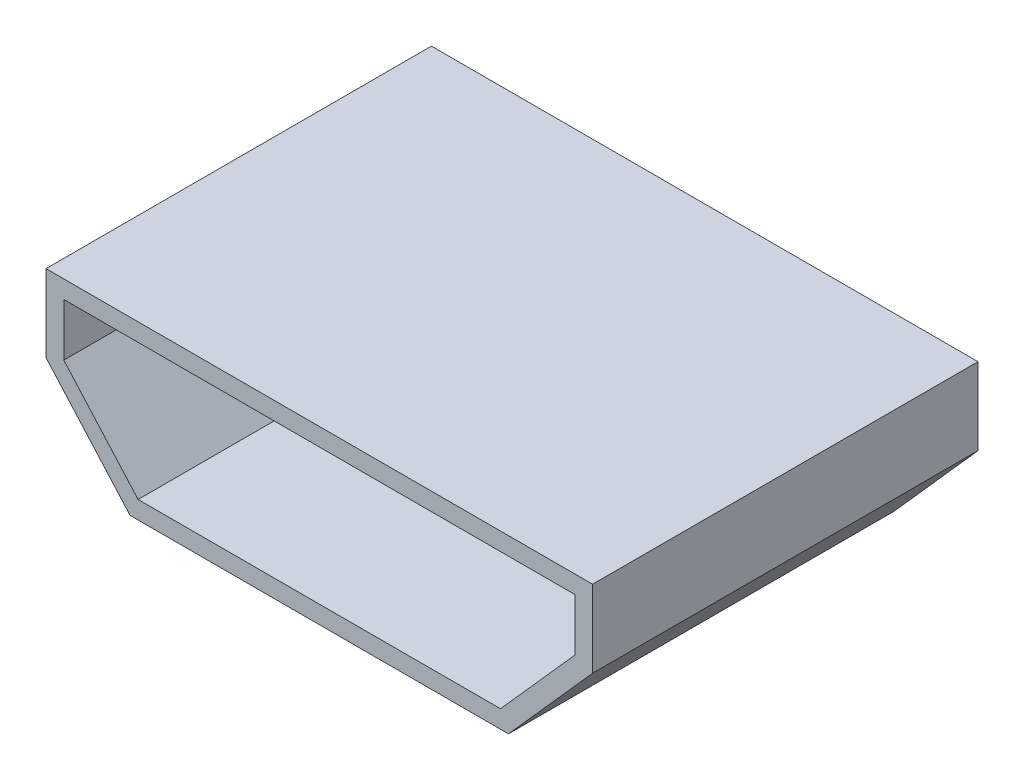
ISO-10303-21;
HEADER;
FILE_DESCRIPTION(('STEP AP214'),'2;1');
FILE_NAME('part.step','',(''),(''),'','','');
FILE_SCHEMA(('AUTOMOTIVE_DESIGN { 1 0 10303 214 1 1 1 1 }'));
ENDSEC;
DATA;
#1=APPLICATION_CONTEXT('core data for automotive mechanical design processes');
#2=APPLICATION_PROTOCOL_DEFINITION('international standard','automotive_design',2000,#1);
#3=PRODUCT_CONTEXT('',#1,'mechanical');
#4=PRODUCT('Part','Part','',(#3));
#5=PRODUCT_RELATED_PRODUCT_CATEGORY('part','',(#4));
#6=PRODUCT_DEFINITION_FORMATION('','',#4);
#7=PRODUCT_DEFINITION_CONTEXT('part definition',#1,'design');
#8=PRODUCT_DEFINITION('design','',#6,#7);
#9=PRODUCT_DEFINITION_SHAPE('','',#8);
#10=(LENGTH_UNIT() NAMED_UNIT(*) SI_UNIT(.MILLI.,.METRE.));
#11=(NAMED_UNIT(*) PLANE_ANGLE_UNIT() SI_UNIT($,.RADIAN.));
#12=(NAMED_UNIT(*) SI_UNIT($,.STERADIAN.) SOLID_ANGLE_UNIT());
#13=UNCERTAINTY_MEASURE_WITH_UNIT(LENGTH_MEASURE(1.E-05),#10,'distance_accuracy_value','');
#14=(GEOMETRIC_REPRESENTATION_CONTEXT(3) GLOBAL_UNCERTAINTY_ASSIGNED_CONTEXT((#13)) GLOBAL_UNIT_ASSIGNED_CONTEXT((#10,
#11,#12)) REPRESENTATION_CONTEXT('',''));
#15=CARTESIAN_POINT('',(0.,0.,0.));
#16=DIRECTION('',(0.,0.,1.));
#17=DIRECTION('',(1.,0.,0.));
#18=AXIS2_PLACEMENT_3D('',#15,#16,#17);
#19=CARTESIAN_POINT('',(2.7,0.,5.5));
#20=DIRECTION('',(-0.74740931868366,0.66436383882992,0.));
#21=DIRECTION('',(-0.66436383882992,-0.74740931868366,0.));
#22=AXIS2_PLACEMENT_3D('',#19,#20,#21);
#23=PLANE('',#22);
#24=DIRECTION('',(0.66436383882992,0.74740931868366,0.));
#25=VECTOR('',#24,1.);
#26=CARTESIAN_POINT('',(2.7,0.,0.));
#27=LINE('',#26,#25);
#28=CARTESIAN_POINT('',(2.7,0.,0.));
#29=VERTEX_POINT('',#28);
#30=CARTESIAN_POINT('',(3.9,1.35,0.));
#31=VERTEX_POINT('',#30);
#32=EDGE_CURVE('E128',#29,#31,#27,.T.);
#33=ORIENTED_EDGE('',*,*,#32,.T.);
#34=DIRECTION('',(0.,0.,-1.));
#35=VECTOR('',#34,1.);
#36=CARTESIAN_POINT('',(3.9,1.35,5.5));
#37=LINE('',#36,#35);
#38=CARTESIAN_POINT('',(3.9,1.35,5.5));
#39=VERTEX_POINT('',#38);
#40=EDGE_CURVE('E11',#39,#31,#37,.T.);
#41=ORIENTED_EDGE('',*,*,#40,.F.);
#42=DIRECTION('',(0.66436383882992,0.74740931868366,0.));
#43=VECTOR('',#42,1.);
#44=CARTESIAN_POINT('',(2.7,0.,5.5));
#45=LINE('',#44,#43);
#46=CARTESIAN_POINT('',(2.7,0.,5.5));
#47=VERTEX_POINT('',#46);
#48=EDGE_CURVE('E140',#47,#39,#45,.T.);
#49=ORIENTED_EDGE('',*,*,#48,.F.);
#50=DIRECTION('',(0.,0.,-1.));
#51=VECTOR('',#50,1.);
#52=CARTESIAN_POINT('',(2.7,0.,5.5));
#53=LINE('',#52,#51);
#54=EDGE_CURVE('E124',#47,#29,#53,.T.);
#55=ORIENTED_EDGE('',*,*,#54,.T.);
#56=EDGE_LOOP('',(#33,#41,#49,#55));
#57=FACE_BOUND('',#56,.T.);
#58=ADVANCED_FACE('F33',(#57),#23,.F.);
#59=CARTESIAN_POINT('',(3.9,1.35,5.5));
#60=DIRECTION('',(-1.,0.,0.));
#61=DIRECTION('',(0.,-1.,0.));
#62=AXIS2_PLACEMENT_3D('',#59,#60,#61);
#63=PLANE('',#62);
#64=DIRECTION('',(0.,1.,0.));
#65=VECTOR('',#64,1.);
#66=CARTESIAN_POINT('',(3.9,1.35,0.));
#67=LINE('',#66,#65);
#68=CARTESIAN_POINT('',(3.9,2.45,0.));
#69=VERTEX_POINT('',#68);
#70=EDGE_CURVE('E131',#31,#69,#67,.T.);
#71=ORIENTED_EDGE('',*,*,#70,.T.);
#72=DIRECTION('',(0.,0.,-1.));
#73=VECTOR('',#72,1.);
#74=CARTESIAN_POINT('',(3.9,2.45,5.5));
#75=LINE('',#74,#73);
#76=CARTESIAN_POINT('',(3.9,2.45,5.5));
#77=VERTEX_POINT('',#76);
#78=EDGE_CURVE('E40',#77,#69,#75,.T.);
#79=ORIENTED_EDGE('',*,*,#78,.F.);
#80=DIRECTION('',(0.,1.,0.));
#81=VECTOR('',#80,1.);
#82=CARTESIAN_POINT('',(3.9,1.35,5.5));
#83=LINE('',#82,#81);
#84=EDGE_CURVE('E91',#39,#77,#83,.T.);
#85=ORIENTED_EDGE('',*,*,#84,.F.);
#86=ORIENTED_EDGE('',*,*,#40,.T.);
#87=EDGE_LOOP('',(#71,#79,#85,#86));
#88=FACE_BOUND('',#87,.T.);
#89=ADVANCED_FACE('F263',(#88),#63,.F.);
#90=CARTESIAN_POINT('',(3.9,2.45,5.5));
#91=DIRECTION('',(0.,-1.,0.));
#92=DIRECTION('',(1.,0.,0.));
#93=AXIS2_PLACEMENT_3D('',#90,#91,#92);
#94=PLANE('',#93);
#95=DIRECTION('',(-1.,0.,0.));
#96=VECTOR('',#95,1.);
#97=CARTESIAN_POINT('',(3.9,2.45,0.));
#98=LINE('',#97,#96);
#99=CARTESIAN_POINT('',(-3.9,2.45,0.));
#100=VERTEX_POINT('',#99);
#101=EDGE_CURVE('E134',#69,#100,#98,.T.);
#102=ORIENTED_EDGE('',*,*,#101,.T.);
#103=DIRECTION('',(0.,0.,-1.));
#104=VECTOR('',#103,1.);
#105=CARTESIAN_POINT('',(-3.9,2.45,5.5));
#106=LINE('',#105,#104);
#107=CARTESIAN_POINT('',(-3.9,2.45,5.5));
#108=VERTEX_POINT('',#107);
#109=EDGE_CURVE('E119',#108,#100,#106,.T.);
#110=ORIENTED_EDGE('',*,*,#109,.F.);
#111=DIRECTION('',(-1.,0.,0.));
#112=VECTOR('',#111,1.);
#113=CARTESIAN_POINT('',(3.9,2.45,5.5));
#114=LINE('',#113,#112);
#115=EDGE_CURVE('E107',#77,#108,#114,.T.);
#116=ORIENTED_EDGE('',*,*,#115,.F.);
#117=ORIENTED_EDGE('',*,*,#78,.T.);
#118=EDGE_LOOP('',(#102,#110,#116,#117));
#119=FACE_BOUND('',#118,.T.);
#120=ADVANCED_FACE('F146',(#119),#94,.F.);
#121=CARTESIAN_POINT('',(-3.9,1.35,5.5));
#122=DIRECTION('',(1.,0.,0.));
#123=DIRECTION('',(0.,1.,0.));
#124=AXIS2_PLACEMENT_3D('',#121,#122,#123);
#125=PLANE('',#124);
#126=DIRECTION('',(0.,-1.,0.));
#127=VECTOR('',#126,1.);
#128=CARTESIAN_POINT('',(-3.9,1.35,0.));
#129=LINE('',#128,#127);
#130=CARTESIAN_POINT('',(-3.9,1.35,0.));
#131=VERTEX_POINT('',#130);
#132=EDGE_CURVE('E116',#100,#131,#129,.T.);
#133=ORIENTED_EDGE('',*,*,#132,.T.);
#134=DIRECTION('',(0.,0.,-1.));
#135=VECTOR('',#134,1.);
#136=CARTESIAN_POINT('',(-3.9,1.35,5.5));
#137=LINE('',#136,#135);
#138=CARTESIAN_POINT('',(-3.9,1.35,5.5));
#139=VERTEX_POINT('',#138);
#140=EDGE_CURVE('E113',#139,#131,#137,.T.);
#141=ORIENTED_EDGE('',*,*,#140,.F.);
#142=DIRECTION('',(0.,-1.,0.));
#143=VECTOR('',#142,1.);
#144=CARTESIAN_POINT('',(-3.9,1.35,5.5));
#145=LINE('',#144,#143);
#146=EDGE_CURVE('E100',#108,#139,#145,.T.);
#147=ORIENTED_EDGE('',*,*,#146,.F.);
#148=ORIENTED_EDGE('',*,*,#109,.T.);
#149=EDGE_LOOP('',(#133,#141,#147,#148));
#150=FACE_BOUND('',#149,.T.);
#151=ADVANCED_FACE('F114',(#150),#125,.F.);
#152=CARTESIAN_POINT('',(-2.7,0.,5.5));
#153=DIRECTION('',(0.74740931868366,0.66436383882992,0.));
#154=DIRECTION('',(-0.66436383882992,0.74740931868366,0.));
#155=AXIS2_PLACEMENT_3D('',#152,#153,#154);
#156=PLANE('',#155);
#157=DIRECTION('',(0.66436383882992,-0.74740931868366,0.));
#158=VECTOR('',#157,1.);
#159=CARTESIAN_POINT('',(-2.7,0.,0.));
#160=LINE('',#159,#158);
#161=CARTESIAN_POINT('',(-2.7,0.,0.));
#162=VERTEX_POINT('',#161);
#163=EDGE_CURVE('E137',#131,#162,#160,.T.);
#164=ORIENTED_EDGE('',*,*,#163,.T.);
#165=DIRECTION('',(0.,0.,-1.));
#166=VECTOR('',#165,1.);
#167=CARTESIAN_POINT('',(-2.7,0.,5.5));
#168=LINE('',#167,#166);
#169=CARTESIAN_POINT('',(-2.7,0.,5.5));
#170=VERTEX_POINT('',#169);
#171=EDGE_CURVE('E120',#170,#162,#168,.T.);
#172=ORIENTED_EDGE('',*,*,#171,.F.);
#173=DIRECTION('',(0.66436383882992,-0.74740931868366,0.));
#174=VECTOR('',#173,1.);
#175=CARTESIAN_POINT('',(-2.7,0.,5.5));
#176=LINE('',#175,#174);
#177=EDGE_CURVE('E104',#139,#170,#176,.T.);
#178=ORIENTED_EDGE('',*,*,#177,.F.);
#179=ORIENTED_EDGE('',*,*,#140,.T.);
#180=EDGE_LOOP('',(#164,#172,#178,#179));
#181=FACE_BOUND('',#180,.T.);
#182=ADVANCED_FACE('F122',(#181),#156,.F.);
#183=CARTESIAN_POINT('',(-2.7,0.,5.5));
#184=DIRECTION('',(0.,1.,0.));
#185=DIRECTION('',(-1.,0.,0.));
#186=AXIS2_PLACEMENT_3D('',#183,#184,#185);
#187=PLANE('',#186);
#188=DIRECTION('',(1.,0.,0.));
#189=VECTOR('',#188,1.);
#190=CARTESIAN_POINT('',(-2.7,0.,0.));
#191=LINE('',#190,#189);
#192=EDGE_CURVE('E83',#162,#29,#191,.T.);
#193=ORIENTED_EDGE('',*,*,#192,.T.);
#194=ORIENTED_EDGE('',*,*,#54,.F.);
#195=DIRECTION('',(1.,0.,0.));
#196=VECTOR('',#195,1.);
#197=CARTESIAN_POINT('',(-2.7,0.,5.5));
#198=LINE('',#197,#196);
#199=EDGE_CURVE('E56',#170,#47,#198,.T.);
#200=ORIENTED_EDGE('',*,*,#199,.F.);
#201=ORIENTED_EDGE('',*,*,#171,.T.);
#202=EDGE_LOOP('',(#193,#194,#200,#201));
#203=FACE_BOUND('',#202,.T.);
#204=ADVANCED_FACE('F150',(#203),#187,.F.);
#205=CARTESIAN_POINT('',(0.,0.,5.5));
#206=DIRECTION('',(0.,0.,1.));
#207=DIRECTION('',(1.,0.,0.));
#208=AXIS2_PLACEMENT_3D('',#205,#206,#207);
#209=PLANE('',#208);
#210=DIRECTION('',(0.66436383882992,0.74740931868366,0.));
#211=VECTOR('',#210,1.);
#212=CARTESIAN_POINT('',(2.51015803305435,0.1687484150628,5.5));
#213=LINE('',#212,#211);
#214=CARTESIAN_POINT('',(2.5859372196652,0.254000000000001,5.5));
#215=VERTEX_POINT('',#214);
#216=CARTESIAN_POINT('',(3.646,1.44657062787666,5.5));
#217=VERTEX_POINT('',#216);
#218=EDGE_CURVE('E171',#215,#217,#213,.T.);
#219=ORIENTED_EDGE('',*,*,#218,.F.);
#220=DIRECTION('',(1.,0.,0.));
#221=VECTOR('',#220,1.);
#222=CARTESIAN_POINT('',(-2.7,0.254,5.5));
#223=LINE('',#222,#221);
#224=CARTESIAN_POINT('',(-2.58593721966519,0.254,5.5));
#225=VERTEX_POINT('',#224);
#226=EDGE_CURVE('E157',#225,#215,#223,.T.);
#227=ORIENTED_EDGE('',*,*,#226,.F.);
#228=DIRECTION('',(0.66436383882992,-0.74740931868366,0.));
#229=VECTOR('',#228,1.);
#230=CARTESIAN_POINT('',(-2.51015803305435,0.1687484150628,5.5));
#231=LINE('',#230,#229);
#232=CARTESIAN_POINT('',(-3.646,1.44657062787665,5.5));
#233=VERTEX_POINT('',#232);
#234=EDGE_CURVE('E160',#233,#225,#231,.T.);
#235=ORIENTED_EDGE('',*,*,#234,.F.);
#236=DIRECTION('',(0.,-1.,0.));
#237=VECTOR('',#236,1.);
#238=CARTESIAN_POINT('',(-3.646,1.35,5.5));
#239=LINE('',#238,#237);
#240=CARTESIAN_POINT('',(-3.646,2.196,5.5));
#241=VERTEX_POINT('',#240);
#242=EDGE_CURVE('E162',#241,#233,#239,.T.);
#243=ORIENTED_EDGE('',*,*,#242,.F.);
#244=DIRECTION('',(-1.,0.,0.));
#245=VECTOR('',#244,1.);
#246=CARTESIAN_POINT('',(3.9,2.196,5.5));
#247=LINE('',#246,#245);
#248=CARTESIAN_POINT('',(3.646,2.196,5.5));
#249=VERTEX_POINT('',#248);
#250=EDGE_CURVE('E165',#249,#241,#247,.T.);
#251=ORIENTED_EDGE('',*,*,#250,.F.);
#252=DIRECTION('',(0.,1.,0.));
#253=VECTOR('',#252,1.);
#254=CARTESIAN_POINT('',(3.646,1.35,5.5));
#255=LINE('',#254,#253);
#256=EDGE_CURVE('E168',#217,#249,#255,.T.);
#257=ORIENTED_EDGE('',*,*,#256,.F.);
#258=EDGE_LOOP('',(#219,#227,#235,#243,#251,#257));
#259=FACE_BOUND('',#258,.T.);
#260=ORIENTED_EDGE('',*,*,#48,.T.);
#261=ORIENTED_EDGE('',*,*,#84,.T.);
#262=ORIENTED_EDGE('',*,*,#115,.T.);
#263=ORIENTED_EDGE('',*,*,#146,.T.);
#264=ORIENTED_EDGE('',*,*,#177,.T.);
#265=ORIENTED_EDGE('',*,*,#199,.T.);
#266=EDGE_LOOP('',(#260,#261,#262,#263,#264,#265));
#267=FACE_BOUND('',#266,.T.);
#268=ADVANCED_FACE('F102',(#259,#267),#209,.T.);
#269=CARTESIAN_POINT('',(0.,0.,0.));
#270=DIRECTION('',(0.,0.,1.));
#271=DIRECTION('',(1.,0.,0.));
#272=AXIS2_PLACEMENT_3D('',#269,#270,#271);
#273=PLANE('',#272);
#274=ORIENTED_EDGE('',*,*,#32,.F.);
#275=ORIENTED_EDGE('',*,*,#192,.F.);
#276=ORIENTED_EDGE('',*,*,#163,.F.);
#277=ORIENTED_EDGE('',*,*,#132,.F.);
#278=ORIENTED_EDGE('',*,*,#101,.F.);
#279=ORIENTED_EDGE('',*,*,#70,.F.);
#280=EDGE_LOOP('',(#274,#275,#276,#277,#278,#279));
#281=FACE_BOUND('',#280,.T.);
#282=ADVANCED_FACE('F149',(#281),#273,.F.);
#283=CARTESIAN_POINT('',(2.51015803305435,0.1687484150628,5.5));
#284=DIRECTION('',(-0.74740931868366,0.66436383882992,0.));
#285=DIRECTION('',(-0.66436383882992,-0.74740931868366,0.));
#286=AXIS2_PLACEMENT_3D('',#283,#284,#285);
#287=PLANE('',#286);
#288=DIRECTION('',(0.66436383882992,0.74740931868366,0.));
#289=VECTOR('',#288,1.);
#290=CARTESIAN_POINT('',(2.51015803305435,0.1687484150628,0.254));
#291=LINE('',#290,#289);
#292=CARTESIAN_POINT('',(2.5859372196652,0.254000000000001,0.254));
#293=VERTEX_POINT('',#292);
#294=CARTESIAN_POINT('',(3.646,1.44657062787666,0.254));
#295=VERTEX_POINT('',#294);
#296=EDGE_CURVE('E199',#293,#295,#291,.T.);
#297=ORIENTED_EDGE('',*,*,#296,.F.);
#298=DIRECTION('',(0.,0.,-1.));
#299=VECTOR('',#298,1.);
#300=CARTESIAN_POINT('',(2.5859372196652,0.254000000000001,5.5));
#301=LINE('',#300,#299);
#302=EDGE_CURVE('E159',#215,#293,#301,.T.);
#303=ORIENTED_EDGE('',*,*,#302,.F.);
#304=ORIENTED_EDGE('',*,*,#218,.T.);
#305=DIRECTION('',(0.,0.,-1.));
#306=VECTOR('',#305,1.);
#307=CARTESIAN_POINT('',(3.646,1.44657062787666,5.5));
#308=LINE('',#307,#306);
#309=EDGE_CURVE('E132',#217,#295,#308,.T.);
#310=ORIENTED_EDGE('',*,*,#309,.T.);
#311=EDGE_LOOP('',(#297,#303,#304,#310));
#312=FACE_BOUND('',#311,.T.);
#313=ADVANCED_FACE('F215',(#312),#287,.T.);
#314=CARTESIAN_POINT('',(3.646,1.35,5.5));
#315=DIRECTION('',(-1.,0.,0.));
#316=DIRECTION('',(0.,-1.,0.));
#317=AXIS2_PLACEMENT_3D('',#314,#315,#316);
#318=PLANE('',#317);
#319=DIRECTION('',(0.,1.,0.));
#320=VECTOR('',#319,1.);
#321=CARTESIAN_POINT('',(3.646,1.35,0.254));
#322=LINE('',#321,#320);
#323=CARTESIAN_POINT('',(3.646,2.196,0.254));
#324=VERTEX_POINT('',#323);
#325=EDGE_CURVE('E194',#295,#324,#322,.T.);
#326=ORIENTED_EDGE('',*,*,#325,.F.);
#327=ORIENTED_EDGE('',*,*,#309,.F.);
#328=ORIENTED_EDGE('',*,*,#256,.T.);
#329=DIRECTION('',(0.,0.,-1.));
#330=VECTOR('',#329,1.);
#331=CARTESIAN_POINT('',(3.646,2.196,5.5));
#332=LINE('',#331,#330);
#333=EDGE_CURVE('E191',#249,#324,#332,.T.);
#334=ORIENTED_EDGE('',*,*,#333,.T.);
#335=EDGE_LOOP('',(#326,#327,#328,#334));
#336=FACE_BOUND('',#335,.T.);
#337=ADVANCED_FACE('F241',(#336),#318,.T.);
#338=CARTESIAN_POINT('',(3.9,2.196,5.5));
#339=DIRECTION('',(0.,-1.,0.));
#340=DIRECTION('',(1.,0.,0.));
#341=AXIS2_PLACEMENT_3D('',#338,#339,#340);
#342=PLANE('',#341);
#343=DIRECTION('',(-1.,0.,0.));
#344=VECTOR('',#343,1.);
#345=CARTESIAN_POINT('',(3.9,2.196,0.254));
#346=LINE('',#345,#344);
#347=CARTESIAN_POINT('',(-3.646,2.196,0.254));
#348=VERTEX_POINT('',#347);
#349=EDGE_CURVE('E188',#324,#348,#346,.T.);
#350=ORIENTED_EDGE('',*,*,#349,.F.);
#351=ORIENTED_EDGE('',*,*,#333,.F.);
#352=ORIENTED_EDGE('',*,*,#250,.T.);
#353=DIRECTION('',(0.,0.,-1.));
#354=VECTOR('',#353,1.);
#355=CARTESIAN_POINT('',(-3.646,2.196,5.5));
#356=LINE('',#355,#354);
#357=EDGE_CURVE('E185',#241,#348,#356,.T.);
#358=ORIENTED_EDGE('',*,*,#357,.T.);
#359=EDGE_LOOP('',(#350,#351,#352,#358));
#360=FACE_BOUND('',#359,.T.);
#361=ADVANCED_FACE('F247',(#360),#342,.T.);
#362=CARTESIAN_POINT('',(-3.646,1.35,5.5));
#363=DIRECTION('',(1.,0.,0.));
#364=DIRECTION('',(0.,1.,0.));
#365=AXIS2_PLACEMENT_3D('',#362,#363,#364);
#366=PLANE('',#365);
#367=DIRECTION('',(0.,-1.,0.));
#368=VECTOR('',#367,1.);
#369=CARTESIAN_POINT('',(-3.646,1.35,0.254));
#370=LINE('',#369,#368);
#371=CARTESIAN_POINT('',(-3.646,1.44657062787665,0.254));
#372=VERTEX_POINT('',#371);
#373=EDGE_CURVE('E182',#348,#372,#370,.T.);
#374=ORIENTED_EDGE('',*,*,#373,.F.);
#375=ORIENTED_EDGE('',*,*,#357,.F.);
#376=ORIENTED_EDGE('',*,*,#242,.T.);
#377=DIRECTION('',(0.,0.,-1.));
#378=VECTOR('',#377,1.);
#379=CARTESIAN_POINT('',(-3.646,1.44657062787666,5.5));
#380=LINE('',#379,#378);
#381=EDGE_CURVE('E179',#233,#372,#380,.T.);
#382=ORIENTED_EDGE('',*,*,#381,.T.);
#383=EDGE_LOOP('',(#374,#375,#376,#382));
#384=FACE_BOUND('',#383,.T.);
#385=ADVANCED_FACE('F251',(#384),#366,.T.);
#386=CARTESIAN_POINT('',(-2.51015803305435,0.1687484150628,5.5));
#387=DIRECTION('',(0.74740931868366,0.66436383882992,0.));
#388=DIRECTION('',(-0.66436383882992,0.74740931868366,0.));
#389=AXIS2_PLACEMENT_3D('',#386,#387,#388);
#390=PLANE('',#389);
#391=DIRECTION('',(0.66436383882992,-0.74740931868366,0.));
#392=VECTOR('',#391,1.);
#393=CARTESIAN_POINT('',(-2.51015803305435,0.1687484150628,0.254));
#394=LINE('',#393,#392);
#395=CARTESIAN_POINT('',(-2.58593721966519,0.254,0.254));
#396=VERTEX_POINT('',#395);
#397=EDGE_CURVE('E177',#372,#396,#394,.T.);
#398=ORIENTED_EDGE('',*,*,#397,.F.);
#399=ORIENTED_EDGE('',*,*,#381,.F.);
#400=ORIENTED_EDGE('',*,*,#234,.T.);
#401=DIRECTION('',(0.,0.,-1.));
#402=VECTOR('',#401,1.);
#403=CARTESIAN_POINT('',(-2.58593721966519,0.254,5.5));
#404=LINE('',#403,#402);
#405=EDGE_CURVE('E47',#225,#396,#404,.T.);
#406=ORIENTED_EDGE('',*,*,#405,.T.);
#407=EDGE_LOOP('',(#398,#399,#400,#406));
#408=FACE_BOUND('',#407,.T.);
#409=ADVANCED_FACE('F253',(#408),#390,.T.);
#410=CARTESIAN_POINT('',(-2.7,0.254,5.5));
#411=DIRECTION('',(0.,1.,0.));
#412=DIRECTION('',(-1.,0.,0.));
#413=AXIS2_PLACEMENT_3D('',#410,#411,#412);
#414=PLANE('',#413);
#415=DIRECTION('',(1.,0.,0.));
#416=VECTOR('',#415,1.);
#417=CARTESIAN_POINT('',(-2.7,0.254,0.254));
#418=LINE('',#417,#416);
#419=EDGE_CURVE('E174',#396,#293,#418,.T.);
#420=ORIENTED_EDGE('',*,*,#419,.F.);
#421=ORIENTED_EDGE('',*,*,#405,.F.);
#422=ORIENTED_EDGE('',*,*,#226,.T.);
#423=ORIENTED_EDGE('',*,*,#302,.T.);
#424=EDGE_LOOP('',(#420,#421,#422,#423));
#425=FACE_BOUND('',#424,.T.);
#426=ADVANCED_FACE('F235',(#425),#414,.T.);
#427=CARTESIAN_POINT('',(0.,0.,0.254));
#428=DIRECTION('',(0.,0.,1.));
#429=DIRECTION('',(1.,0.,0.));
#430=AXIS2_PLACEMENT_3D('',#427,#428,#429);
#431=PLANE('',#430);
#432=ORIENTED_EDGE('',*,*,#296,.T.);
#433=ORIENTED_EDGE('',*,*,#325,.T.);
#434=ORIENTED_EDGE('',*,*,#349,.T.);
#435=ORIENTED_EDGE('',*,*,#373,.T.);
#436=ORIENTED_EDGE('',*,*,#397,.T.);
#437=ORIENTED_EDGE('',*,*,#419,.T.);
#438=EDGE_LOOP('',(#432,#433,#434,#435,#436,#437));
#439=FACE_BOUND('',#438,.T.);
#440=ADVANCED_FACE('F208',(#439),#431,.T.);
#441=CLOSED_SHELL('',(#58,#89,#120,#151,#182,#204,#268,#282,#313,#337,#361,#385,#409,#426,#440));
#442=MANIFOLD_SOLID_BREP('B2',#441);
#443=ADVANCED_BREP_SHAPE_REPRESENTATION('',(#18,#442),#14);
#444=SHAPE_DEFINITION_REPRESENTATION(#9,#443);
ENDSEC;
END-ISO-10303-21;
